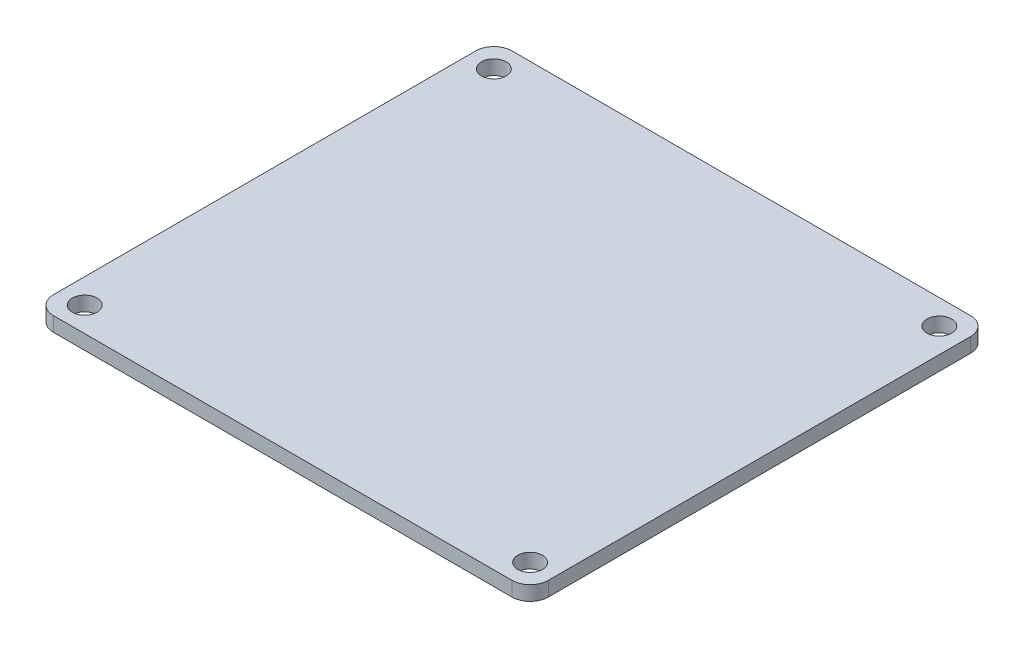
ISO-10303-21;
HEADER;
FILE_DESCRIPTION(('STEP AP214'),'2;1');
FILE_NAME('part.step','',(''),(''),'','','');
FILE_SCHEMA(('AUTOMOTIVE_DESIGN { 1 0 10303 214 1 1 1 1 }'));
ENDSEC;
DATA;
#1=APPLICATION_CONTEXT('core data for automotive mechanical design processes');
#2=APPLICATION_PROTOCOL_DEFINITION('international standard','automotive_design',2000,#1);
#3=PRODUCT_CONTEXT('',#1,'mechanical');
#4=PRODUCT('Part','Part','',(#3));
#5=PRODUCT_RELATED_PRODUCT_CATEGORY('part','',(#4));
#6=PRODUCT_DEFINITION_FORMATION('','',#4);
#7=PRODUCT_DEFINITION_CONTEXT('part definition',#1,'design');
#8=PRODUCT_DEFINITION('design','',#6,#7);
#9=PRODUCT_DEFINITION_SHAPE('','',#8);
#10=(LENGTH_UNIT() NAMED_UNIT(*) SI_UNIT(.MILLI.,.METRE.));
#11=(NAMED_UNIT(*) PLANE_ANGLE_UNIT() SI_UNIT($,.RADIAN.));
#12=(NAMED_UNIT(*) SI_UNIT($,.STERADIAN.) SOLID_ANGLE_UNIT());
#13=UNCERTAINTY_MEASURE_WITH_UNIT(LENGTH_MEASURE(1.E-05),#10,'distance_accuracy_value','');
#14=(GEOMETRIC_REPRESENTATION_CONTEXT(3) GLOBAL_UNCERTAINTY_ASSIGNED_CONTEXT((#13)) GLOBAL_UNIT_ASSIGNED_CONTEXT((#10,
#11,#12)) REPRESENTATION_CONTEXT('',''));
#15=CARTESIAN_POINT('',(0.,0.,0.));
#16=DIRECTION('',(0.,0.,1.));
#17=DIRECTION('',(1.,0.,0.));
#18=AXIS2_PLACEMENT_3D('',#15,#16,#17);
#19=CARTESIAN_POINT('',(-31.6,2.,29.1));
#20=DIRECTION('',(0.,-1.,0.));
#21=DIRECTION('',(0.,0.,-1.));
#22=AXIS2_PLACEMENT_3D('',#19,#20,#21);
#23=PLANE('',#22);
#24=CARTESIAN_POINT('',(-31.6,2.,29.1));
#25=DIRECTION('',(0.,1.,0.));
#26=DIRECTION('',(0.,0.,-1.));
#27=AXIS2_PLACEMENT_3D('',#24,#25,#26);
#28=CIRCLE('',#27,2.5);
#29=CARTESIAN_POINT('',(-34.1,2.,29.1));
#30=VERTEX_POINT('',#29);
#31=CARTESIAN_POINT('',(-31.6,2.,31.6));
#32=VERTEX_POINT('',#31);
#33=EDGE_CURVE('E149',#30,#32,#28,.T.);
#34=ORIENTED_EDGE('',*,*,#33,.T.);
#35=DIRECTION('',(1.,0.,0.));
#36=VECTOR('',#35,1.);
#37=CARTESIAN_POINT('',(31.6,2.,31.6));
#38=LINE('',#37,#36);
#39=CARTESIAN_POINT('',(31.6,2.,31.6));
#40=VERTEX_POINT('',#39);
#41=EDGE_CURVE('E97',#32,#40,#38,.T.);
#42=ORIENTED_EDGE('',*,*,#41,.T.);
#43=CARTESIAN_POINT('',(31.6,2.,29.1));
#44=DIRECTION('',(0.,1.,0.));
#45=DIRECTION('',(0.,0.,-1.));
#46=AXIS2_PLACEMENT_3D('',#43,#44,#45);
#47=CIRCLE('',#46,2.50000000000001);
#48=CARTESIAN_POINT('',(34.1,2.,29.1));
#49=VERTEX_POINT('',#48);
#50=EDGE_CURVE('E164',#40,#49,#47,.T.);
#51=ORIENTED_EDGE('',*,*,#50,.T.);
#52=DIRECTION('',(0.,0.,-1.));
#53=VECTOR('',#52,1.);
#54=CARTESIAN_POINT('',(34.1,2.,-29.1));
#55=LINE('',#54,#53);
#56=CARTESIAN_POINT('',(34.1,2.,-29.1));
#57=VERTEX_POINT('',#56);
#58=EDGE_CURVE('E177',#49,#57,#55,.T.);
#59=ORIENTED_EDGE('',*,*,#58,.T.);
#60=CARTESIAN_POINT('',(31.6,2.,-29.1));
#61=DIRECTION('',(0.,1.,0.));
#62=DIRECTION('',(0.,0.,-1.));
#63=AXIS2_PLACEMENT_3D('',#60,#61,#62);
#64=CIRCLE('',#63,2.5);
#65=CARTESIAN_POINT('',(31.6,2.,-31.6));
#66=VERTEX_POINT('',#65);
#67=EDGE_CURVE('E116',#57,#66,#64,.T.);
#68=ORIENTED_EDGE('',*,*,#67,.T.);
#69=DIRECTION('',(-1.,0.,0.));
#70=VECTOR('',#69,1.);
#71=CARTESIAN_POINT('',(31.6,2.,-31.6));
#72=LINE('',#71,#70);
#73=CARTESIAN_POINT('',(-31.6,2.,-31.6));
#74=VERTEX_POINT('',#73);
#75=EDGE_CURVE('E110',#66,#74,#72,.T.);
#76=ORIENTED_EDGE('',*,*,#75,.T.);
#77=CARTESIAN_POINT('',(-31.6,2.,-29.1));
#78=DIRECTION('',(0.,1.,0.));
#79=DIRECTION('',(0.,0.,1.));
#80=AXIS2_PLACEMENT_3D('',#77,#78,#79);
#81=CIRCLE('',#80,2.5);
#82=CARTESIAN_POINT('',(-34.1,2.,-29.1));
#83=VERTEX_POINT('',#82);
#84=EDGE_CURVE('E114',#74,#83,#81,.T.);
#85=ORIENTED_EDGE('',*,*,#84,.T.);
#86=DIRECTION('',(0.,0.,1.));
#87=VECTOR('',#86,1.);
#88=CARTESIAN_POINT('',(-34.1,2.,-29.1));
#89=LINE('',#88,#87);
#90=EDGE_CURVE('E54',#83,#30,#89,.T.);
#91=ORIENTED_EDGE('',*,*,#90,.T.);
#92=EDGE_LOOP('',(#34,#42,#51,#59,#68,#76,#85,#91));
#93=FACE_BOUND('',#92,.T.);
#94=CARTESIAN_POINT('',(-30.7,2.,-28.2));
#95=DIRECTION('',(0.,1.,0.));
#96=DIRECTION('',(0.,0.,1.));
#97=AXIS2_PLACEMENT_3D('',#94,#95,#96);
#98=CIRCLE('',#97,1.7);
#99=CARTESIAN_POINT('',(-30.7,2.,-26.5));
#100=VERTEX_POINT('',#99);
#101=EDGE_CURVE('E138',#100,#100,#98,.T.);
#102=ORIENTED_EDGE('',*,*,#101,.F.);
#103=EDGE_LOOP('',(#102));
#104=FACE_BOUND('',#103,.T.);
#105=CARTESIAN_POINT('',(30.7,2.,-28.2));
#106=DIRECTION('',(0.,1.,0.));
#107=DIRECTION('',(0.,0.,1.));
#108=AXIS2_PLACEMENT_3D('',#105,#106,#107);
#109=CIRCLE('',#108,1.7);
#110=CARTESIAN_POINT('',(30.7,2.,-26.5));
#111=VERTEX_POINT('',#110);
#112=EDGE_CURVE('E186',#111,#111,#109,.T.);
#113=ORIENTED_EDGE('',*,*,#112,.F.);
#114=EDGE_LOOP('',(#113));
#115=FACE_BOUND('',#114,.T.);
#116=CARTESIAN_POINT('',(-30.7,2.,28.2));
#117=DIRECTION('',(0.,1.,0.));
#118=DIRECTION('',(0.,0.,1.));
#119=AXIS2_PLACEMENT_3D('',#116,#117,#118);
#120=CIRCLE('',#119,1.7);
#121=CARTESIAN_POINT('',(-30.7,2.,29.9));
#122=VERTEX_POINT('',#121);
#123=EDGE_CURVE('E192',#122,#122,#120,.T.);
#124=ORIENTED_EDGE('',*,*,#123,.F.);
#125=EDGE_LOOP('',(#124));
#126=FACE_BOUND('',#125,.T.);
#127=CARTESIAN_POINT('',(30.7,2.,28.2));
#128=DIRECTION('',(0.,1.,0.));
#129=DIRECTION('',(0.,0.,1.));
#130=AXIS2_PLACEMENT_3D('',#127,#128,#129);
#131=CIRCLE('',#130,1.69999999999999);
#132=CARTESIAN_POINT('',(30.7,2.,29.9));
#133=VERTEX_POINT('',#132);
#134=EDGE_CURVE('E198',#133,#133,#131,.T.);
#135=ORIENTED_EDGE('',*,*,#134,.F.);
#136=EDGE_LOOP('',(#135));
#137=FACE_BOUND('',#136,.T.);
#138=ADVANCED_FACE('F37',(#93,#104,#115,#126,#137),#23,.F.);
#139=CARTESIAN_POINT('',(-31.6,0.,29.1));
#140=DIRECTION('',(0.,-1.,0.));
#141=DIRECTION('',(0.,0.,-1.));
#142=AXIS2_PLACEMENT_3D('',#139,#140,#141);
#143=PLANE('',#142);
#144=CARTESIAN_POINT('',(-30.7,0.,28.2));
#145=DIRECTION('',(0.,1.,0.));
#146=DIRECTION('',(0.,0.,1.));
#147=AXIS2_PLACEMENT_3D('',#144,#145,#146);
#148=CIRCLE('',#147,1.7);
#149=CARTESIAN_POINT('',(-30.7,0.,29.9));
#150=VERTEX_POINT('',#149);
#151=EDGE_CURVE('E195',#150,#150,#148,.T.);
#152=ORIENTED_EDGE('',*,*,#151,.T.);
#153=EDGE_LOOP('',(#152));
#154=FACE_BOUND('',#153,.T.);
#155=CARTESIAN_POINT('',(-30.7,0.,-28.2));
#156=DIRECTION('',(0.,1.,0.));
#157=DIRECTION('',(0.,0.,1.));
#158=AXIS2_PLACEMENT_3D('',#155,#156,#157);
#159=CIRCLE('',#158,1.7);
#160=CARTESIAN_POINT('',(-30.7,0.,-26.5));
#161=VERTEX_POINT('',#160);
#162=EDGE_CURVE('E183',#161,#161,#159,.T.);
#163=ORIENTED_EDGE('',*,*,#162,.T.);
#164=EDGE_LOOP('',(#163));
#165=FACE_BOUND('',#164,.T.);
#166=CARTESIAN_POINT('',(-31.6,0.,29.1));
#167=DIRECTION('',(0.,1.,0.));
#168=DIRECTION('',(0.,0.,-1.));
#169=AXIS2_PLACEMENT_3D('',#166,#167,#168);
#170=CIRCLE('',#169,2.5);
#171=CARTESIAN_POINT('',(-34.1,0.,29.1));
#172=VERTEX_POINT('',#171);
#173=CARTESIAN_POINT('',(-31.6,0.,31.6));
#174=VERTEX_POINT('',#173);
#175=EDGE_CURVE('E134',#172,#174,#170,.T.);
#176=ORIENTED_EDGE('',*,*,#175,.F.);
#177=DIRECTION('',(0.,0.,1.));
#178=VECTOR('',#177,1.);
#179=CARTESIAN_POINT('',(-34.1,0.,-29.1));
#180=LINE('',#179,#178);
#181=CARTESIAN_POINT('',(-34.1,0.,-29.1));
#182=VERTEX_POINT('',#181);
#183=EDGE_CURVE('E89',#182,#172,#180,.T.);
#184=ORIENTED_EDGE('',*,*,#183,.F.);
#185=CARTESIAN_POINT('',(-31.6,0.,-29.1));
#186=DIRECTION('',(0.,1.,0.));
#187=DIRECTION('',(0.,0.,1.));
#188=AXIS2_PLACEMENT_3D('',#185,#186,#187);
#189=CIRCLE('',#188,2.5);
#190=CARTESIAN_POINT('',(-31.6,0.,-31.6));
#191=VERTEX_POINT('',#190);
#192=EDGE_CURVE('E83',#191,#182,#189,.T.);
#193=ORIENTED_EDGE('',*,*,#192,.F.);
#194=DIRECTION('',(-1.,0.,0.));
#195=VECTOR('',#194,1.);
#196=CARTESIAN_POINT('',(31.6,0.,-31.6));
#197=LINE('',#196,#195);
#198=CARTESIAN_POINT('',(31.6,0.,-31.6));
#199=VERTEX_POINT('',#198);
#200=EDGE_CURVE('E124',#199,#191,#197,.T.);
#201=ORIENTED_EDGE('',*,*,#200,.F.);
#202=CARTESIAN_POINT('',(31.6,0.,-29.1));
#203=DIRECTION('',(0.,1.,0.));
#204=DIRECTION('',(0.,0.,-1.));
#205=AXIS2_PLACEMENT_3D('',#202,#203,#204);
#206=CIRCLE('',#205,2.5);
#207=CARTESIAN_POINT('',(34.1,0.,-29.1));
#208=VERTEX_POINT('',#207);
#209=EDGE_CURVE('E144',#208,#199,#206,.T.);
#210=ORIENTED_EDGE('',*,*,#209,.F.);
#211=DIRECTION('',(0.,0.,-1.));
#212=VECTOR('',#211,1.);
#213=CARTESIAN_POINT('',(34.1,0.,-29.1));
#214=LINE('',#213,#212);
#215=CARTESIAN_POINT('',(34.1,0.,29.1));
#216=VERTEX_POINT('',#215);
#217=EDGE_CURVE('E142',#216,#208,#214,.T.);
#218=ORIENTED_EDGE('',*,*,#217,.F.);
#219=CARTESIAN_POINT('',(31.6,0.,29.1));
#220=DIRECTION('',(0.,1.,0.));
#221=DIRECTION('',(0.,0.,-1.));
#222=AXIS2_PLACEMENT_3D('',#219,#220,#221);
#223=CIRCLE('',#222,2.50000000000001);
#224=CARTESIAN_POINT('',(31.6,0.,31.6));
#225=VERTEX_POINT('',#224);
#226=EDGE_CURVE('E140',#225,#216,#223,.T.);
#227=ORIENTED_EDGE('',*,*,#226,.F.);
#228=DIRECTION('',(1.,0.,0.));
#229=VECTOR('',#228,1.);
#230=CARTESIAN_POINT('',(31.6,0.,31.6));
#231=LINE('',#230,#229);
#232=EDGE_CURVE('E137',#174,#225,#231,.T.);
#233=ORIENTED_EDGE('',*,*,#232,.F.);
#234=EDGE_LOOP('',(#176,#184,#193,#201,#210,#218,#227,#233));
#235=FACE_BOUND('',#234,.T.);
#236=CARTESIAN_POINT('',(30.7,0.,-28.2));
#237=DIRECTION('',(0.,1.,0.));
#238=DIRECTION('',(0.,0.,1.));
#239=AXIS2_PLACEMENT_3D('',#236,#237,#238);
#240=CIRCLE('',#239,1.7);
#241=CARTESIAN_POINT('',(30.7,0.,-26.5));
#242=VERTEX_POINT('',#241);
#243=EDGE_CURVE('E189',#242,#242,#240,.T.);
#244=ORIENTED_EDGE('',*,*,#243,.T.);
#245=EDGE_LOOP('',(#244));
#246=FACE_BOUND('',#245,.T.);
#247=CARTESIAN_POINT('',(30.7,0.,28.2));
#248=DIRECTION('',(0.,1.,0.));
#249=DIRECTION('',(0.,0.,1.));
#250=AXIS2_PLACEMENT_3D('',#247,#248,#249);
#251=CIRCLE('',#250,1.69999999999999);
#252=CARTESIAN_POINT('',(30.7,0.,29.9));
#253=VERTEX_POINT('',#252);
#254=EDGE_CURVE('E201',#253,#253,#251,.T.);
#255=ORIENTED_EDGE('',*,*,#254,.T.);
#256=EDGE_LOOP('',(#255));
#257=FACE_BOUND('',#256,.T.);
#258=ADVANCED_FACE('F168',(#154,#165,#235,#246,#257),#143,.T.);
#259=CARTESIAN_POINT('',(-31.6,2.,29.1));
#260=DIRECTION('',(0.,-1.,0.));
#261=DIRECTION('',(0.,0.,-1.));
#262=AXIS2_PLACEMENT_3D('',#259,#260,#261);
#263=CYLINDRICAL_SURFACE('',#262,2.5);
#264=ORIENTED_EDGE('',*,*,#175,.T.);
#265=DIRECTION('',(0.,-1.,0.));
#266=VECTOR('',#265,1.);
#267=CARTESIAN_POINT('',(-31.6,2.,31.6));
#268=LINE('',#267,#266);
#269=EDGE_CURVE('E11',#32,#174,#268,.T.);
#270=ORIENTED_EDGE('',*,*,#269,.F.);
#271=ORIENTED_EDGE('',*,*,#33,.F.);
#272=DIRECTION('',(0.,-1.,0.));
#273=VECTOR('',#272,1.);
#274=CARTESIAN_POINT('',(-34.1,2.,29.1));
#275=LINE('',#274,#273);
#276=EDGE_CURVE('E130',#30,#172,#275,.T.);
#277=ORIENTED_EDGE('',*,*,#276,.T.);
#278=EDGE_LOOP('',(#264,#270,#271,#277));
#279=FACE_BOUND('',#278,.T.);
#280=ADVANCED_FACE('F39',(#279),#263,.T.);
#281=CARTESIAN_POINT('',(31.6,2.,31.6));
#282=DIRECTION('',(0.,0.,-1.));
#283=DIRECTION('',(-1.,0.,0.));
#284=AXIS2_PLACEMENT_3D('',#281,#282,#283);
#285=PLANE('',#284);
#286=ORIENTED_EDGE('',*,*,#232,.T.);
#287=DIRECTION('',(0.,-1.,0.));
#288=VECTOR('',#287,1.);
#289=CARTESIAN_POINT('',(31.6,2.,31.6));
#290=LINE('',#289,#288);
#291=EDGE_CURVE('E46',#40,#225,#290,.T.);
#292=ORIENTED_EDGE('',*,*,#291,.F.);
#293=ORIENTED_EDGE('',*,*,#41,.F.);
#294=ORIENTED_EDGE('',*,*,#269,.T.);
#295=EDGE_LOOP('',(#286,#292,#293,#294));
#296=FACE_BOUND('',#295,.T.);
#297=ADVANCED_FACE('F233',(#296),#285,.F.);
#298=CARTESIAN_POINT('',(31.6,2.,29.1));
#299=DIRECTION('',(0.,-1.,0.));
#300=DIRECTION('',(0.,0.,-1.));
#301=AXIS2_PLACEMENT_3D('',#298,#299,#300);
#302=CYLINDRICAL_SURFACE('',#301,2.50000000000001);
#303=ORIENTED_EDGE('',*,*,#226,.T.);
#304=DIRECTION('',(0.,-1.,0.));
#305=VECTOR('',#304,1.);
#306=CARTESIAN_POINT('',(34.1,2.,29.1));
#307=LINE('',#306,#305);
#308=EDGE_CURVE('E156',#49,#216,#307,.T.);
#309=ORIENTED_EDGE('',*,*,#308,.F.);
#310=ORIENTED_EDGE('',*,*,#50,.F.);
#311=ORIENTED_EDGE('',*,*,#291,.T.);
#312=EDGE_LOOP('',(#303,#309,#310,#311));
#313=FACE_BOUND('',#312,.T.);
#314=ADVANCED_FACE('F162',(#313),#302,.T.);
#315=CARTESIAN_POINT('',(34.1,2.,-29.1));
#316=DIRECTION('',(-1.,0.,0.));
#317=DIRECTION('',(0.,0.,1.));
#318=AXIS2_PLACEMENT_3D('',#315,#316,#317);
#319=PLANE('',#318);
#320=ORIENTED_EDGE('',*,*,#217,.T.);
#321=DIRECTION('',(0.,-1.,0.));
#322=VECTOR('',#321,1.);
#323=CARTESIAN_POINT('',(34.1,2.,-29.1));
#324=LINE('',#323,#322);
#325=EDGE_CURVE('E153',#57,#208,#324,.T.);
#326=ORIENTED_EDGE('',*,*,#325,.F.);
#327=ORIENTED_EDGE('',*,*,#58,.F.);
#328=ORIENTED_EDGE('',*,*,#308,.T.);
#329=EDGE_LOOP('',(#320,#326,#327,#328));
#330=FACE_BOUND('',#329,.T.);
#331=ADVANCED_FACE('F173',(#330),#319,.F.);
#332=CARTESIAN_POINT('',(31.6,2.,-29.1));
#333=DIRECTION('',(0.,-1.,0.));
#334=DIRECTION('',(0.,0.,-1.));
#335=AXIS2_PLACEMENT_3D('',#332,#333,#334);
#336=CYLINDRICAL_SURFACE('',#335,2.5);
#337=ORIENTED_EDGE('',*,*,#209,.T.);
#338=DIRECTION('',(0.,-1.,0.));
#339=VECTOR('',#338,1.);
#340=CARTESIAN_POINT('',(31.6,2.,-31.6));
#341=LINE('',#340,#339);
#342=EDGE_CURVE('E125',#66,#199,#341,.T.);
#343=ORIENTED_EDGE('',*,*,#342,.F.);
#344=ORIENTED_EDGE('',*,*,#67,.F.);
#345=ORIENTED_EDGE('',*,*,#325,.T.);
#346=EDGE_LOOP('',(#337,#343,#344,#345));
#347=FACE_BOUND('',#346,.T.);
#348=ADVANCED_FACE('F176',(#347),#336,.T.);
#349=CARTESIAN_POINT('',(31.6,2.,-31.6));
#350=DIRECTION('',(0.,0.,1.));
#351=DIRECTION('',(1.,0.,0.));
#352=AXIS2_PLACEMENT_3D('',#349,#350,#351);
#353=PLANE('',#352);
#354=ORIENTED_EDGE('',*,*,#200,.T.);
#355=DIRECTION('',(0.,-1.,0.));
#356=VECTOR('',#355,1.);
#357=CARTESIAN_POINT('',(-31.6,2.,-31.6));
#358=LINE('',#357,#356);
#359=EDGE_CURVE('E121',#74,#191,#358,.T.);
#360=ORIENTED_EDGE('',*,*,#359,.F.);
#361=ORIENTED_EDGE('',*,*,#75,.F.);
#362=ORIENTED_EDGE('',*,*,#342,.T.);
#363=EDGE_LOOP('',(#354,#360,#361,#362));
#364=FACE_BOUND('',#363,.T.);
#365=ADVANCED_FACE('F122',(#364),#353,.F.);
#366=CARTESIAN_POINT('',(-31.6,2.,-29.1));
#367=DIRECTION('',(0.,-1.,0.));
#368=DIRECTION('',(0.,0.,-1.));
#369=AXIS2_PLACEMENT_3D('',#366,#367,#368);
#370=CYLINDRICAL_SURFACE('',#369,2.5);
#371=ORIENTED_EDGE('',*,*,#192,.T.);
#372=DIRECTION('',(0.,-1.,0.));
#373=VECTOR('',#372,1.);
#374=CARTESIAN_POINT('',(-34.1,2.,-29.1));
#375=LINE('',#374,#373);
#376=EDGE_CURVE('E126',#83,#182,#375,.T.);
#377=ORIENTED_EDGE('',*,*,#376,.F.);
#378=ORIENTED_EDGE('',*,*,#84,.F.);
#379=ORIENTED_EDGE('',*,*,#359,.T.);
#380=EDGE_LOOP('',(#371,#377,#378,#379));
#381=FACE_BOUND('',#380,.T.);
#382=ADVANCED_FACE('F128',(#381),#370,.T.);
#383=CARTESIAN_POINT('',(-34.1,2.,-29.1));
#384=DIRECTION('',(1.,0.,0.));
#385=DIRECTION('',(0.,0.,-1.));
#386=AXIS2_PLACEMENT_3D('',#383,#384,#385);
#387=PLANE('',#386);
#388=ORIENTED_EDGE('',*,*,#183,.T.);
#389=ORIENTED_EDGE('',*,*,#276,.F.);
#390=ORIENTED_EDGE('',*,*,#90,.F.);
#391=ORIENTED_EDGE('',*,*,#376,.T.);
#392=EDGE_LOOP('',(#388,#389,#390,#391));
#393=FACE_BOUND('',#392,.T.);
#394=ADVANCED_FACE('F221',(#393),#387,.F.);
#395=CARTESIAN_POINT('',(-30.7,2.,-28.2));
#396=DIRECTION('',(0.,-1.,0.));
#397=DIRECTION('',(0.,0.,-1.));
#398=AXIS2_PLACEMENT_3D('',#395,#396,#397);
#399=CYLINDRICAL_SURFACE('',#398,1.7);
#400=ORIENTED_EDGE('',*,*,#101,.T.);
#401=EDGE_LOOP('',(#400));
#402=FACE_BOUND('',#401,.T.);
#403=ORIENTED_EDGE('',*,*,#162,.F.);
#404=EDGE_LOOP('',(#403));
#405=FACE_BOUND('',#404,.T.);
#406=ADVANCED_FACE('F218',(#402,#405),#399,.F.);
#407=CARTESIAN_POINT('',(30.7,2.,-28.2));
#408=DIRECTION('',(0.,-1.,0.));
#409=DIRECTION('',(0.,0.,-1.));
#410=AXIS2_PLACEMENT_3D('',#407,#408,#409);
#411=CYLINDRICAL_SURFACE('',#410,1.7);
#412=ORIENTED_EDGE('',*,*,#112,.T.);
#413=EDGE_LOOP('',(#412));
#414=FACE_BOUND('',#413,.T.);
#415=ORIENTED_EDGE('',*,*,#243,.F.);
#416=EDGE_LOOP('',(#415));
#417=FACE_BOUND('',#416,.T.);
#418=ADVANCED_FACE('F297',(#414,#417),#411,.F.);
#419=CARTESIAN_POINT('',(-30.7,2.,28.2));
#420=DIRECTION('',(0.,-1.,0.));
#421=DIRECTION('',(0.,0.,-1.));
#422=AXIS2_PLACEMENT_3D('',#419,#420,#421);
#423=CYLINDRICAL_SURFACE('',#422,1.7);
#424=ORIENTED_EDGE('',*,*,#123,.T.);
#425=EDGE_LOOP('',(#424));
#426=FACE_BOUND('',#425,.T.);
#427=ORIENTED_EDGE('',*,*,#151,.F.);
#428=EDGE_LOOP('',(#427));
#429=FACE_BOUND('',#428,.T.);
#430=ADVANCED_FACE('F305',(#426,#429),#423,.F.);
#431=CARTESIAN_POINT('',(30.7,2.,28.2));
#432=DIRECTION('',(0.,-1.,0.));
#433=DIRECTION('',(0.,0.,-1.));
#434=AXIS2_PLACEMENT_3D('',#431,#432,#433);
#435=CYLINDRICAL_SURFACE('',#434,1.69999999999999);
#436=ORIENTED_EDGE('',*,*,#134,.T.);
#437=EDGE_LOOP('',(#436));
#438=FACE_BOUND('',#437,.T.);
#439=ORIENTED_EDGE('',*,*,#254,.F.);
#440=EDGE_LOOP('',(#439));
#441=FACE_BOUND('',#440,.T.);
#442=ADVANCED_FACE('F207',(#438,#441),#435,.F.);
#443=CLOSED_SHELL('',(#138,#258,#280,#297,#314,#331,#348,#365,#382,#394,#406,#418,#430,#442));
#444=MANIFOLD_SOLID_BREP('B2',#443);
#445=ADVANCED_BREP_SHAPE_REPRESENTATION('',(#18,#444),#14);
#446=SHAPE_DEFINITION_REPRESENTATION(#9,#445);
ENDSEC;
END-ISO-10303-21;
